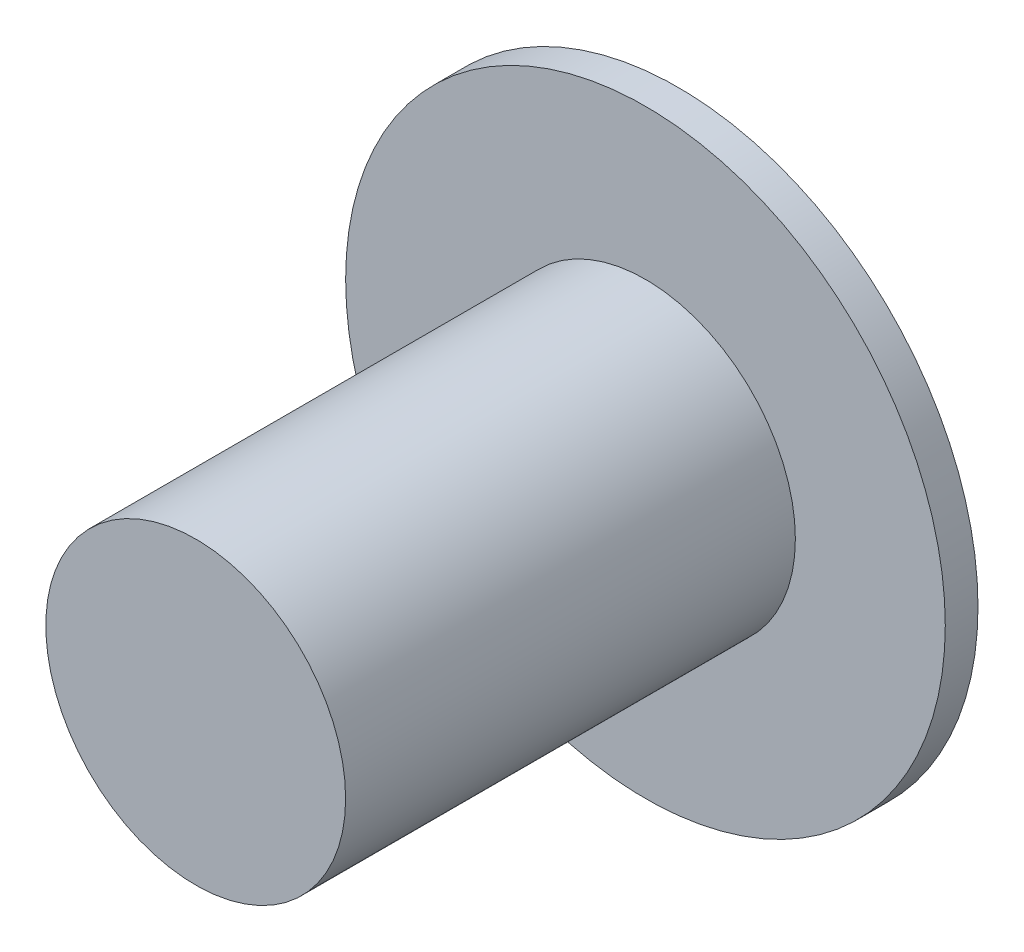
ISO-10303-21;
HEADER;
FILE_DESCRIPTION(('STEP AP214'),'2;1');
FILE_NAME('part.step','',(''),(''),'','','');
FILE_SCHEMA(('AUTOMOTIVE_DESIGN { 1 0 10303 214 1 1 1 1 }'));
ENDSEC;
DATA;
#1=APPLICATION_CONTEXT('core data for automotive mechanical design processes');
#2=APPLICATION_PROTOCOL_DEFINITION('international standard','automotive_design',2000,#1);
#3=PRODUCT_CONTEXT('',#1,'mechanical');
#4=PRODUCT('Part','Part','',(#3));
#5=PRODUCT_RELATED_PRODUCT_CATEGORY('part','',(#4));
#6=PRODUCT_DEFINITION_FORMATION('','',#4);
#7=PRODUCT_DEFINITION_CONTEXT('part definition',#1,'design');
#8=PRODUCT_DEFINITION('design','',#6,#7);
#9=PRODUCT_DEFINITION_SHAPE('','',#8);
#10=(LENGTH_UNIT() NAMED_UNIT(*) SI_UNIT(.MILLI.,.METRE.));
#11=(NAMED_UNIT(*) PLANE_ANGLE_UNIT() SI_UNIT($,.RADIAN.));
#12=(NAMED_UNIT(*) SI_UNIT($,.STERADIAN.) SOLID_ANGLE_UNIT());
#13=UNCERTAINTY_MEASURE_WITH_UNIT(LENGTH_MEASURE(1.E-05),#10,'distance_accuracy_value','');
#14=(GEOMETRIC_REPRESENTATION_CONTEXT(3) GLOBAL_UNCERTAINTY_ASSIGNED_CONTEXT((#13)) GLOBAL_UNIT_ASSIGNED_CONTEXT((#10,
#11,#12)) REPRESENTATION_CONTEXT('',''));
#15=CARTESIAN_POINT('',(0.,0.,0.));
#16=DIRECTION('',(0.,0.,1.));
#17=DIRECTION('',(1.,0.,0.));
#18=AXIS2_PLACEMENT_3D('',#15,#16,#17);
#19=CARTESIAN_POINT('',(0.,0.,5.));
#20=DIRECTION('',(0.,0.,-1.));
#21=DIRECTION('',(-1.,0.,0.));
#22=AXIS2_PLACEMENT_3D('',#19,#20,#21);
#23=CYLINDRICAL_SURFACE('',#22,11.);
#24=CARTESIAN_POINT('',(0.,0.,5.));
#25=DIRECTION('',(0.,0.,1.));
#26=DIRECTION('',(1.,0.,0.));
#27=AXIS2_PLACEMENT_3D('',#24,#25,#26);
#28=CIRCLE('',#27,11.);
#29=CARTESIAN_POINT('',(11.,0.,5.));
#30=VERTEX_POINT('',#29);
#31=EDGE_CURVE('E42',#30,#30,#28,.T.);
#32=ORIENTED_EDGE('',*,*,#31,.F.);
#33=EDGE_LOOP('',(#32));
#34=FACE_BOUND('',#33,.T.);
#35=CARTESIAN_POINT('',(0.,0.,0.));
#36=DIRECTION('',(0.,0.,1.));
#37=DIRECTION('',(1.,0.,0.));
#38=AXIS2_PLACEMENT_3D('',#35,#36,#37);
#39=CIRCLE('',#38,11.);
#40=CARTESIAN_POINT('',(11.,0.,0.));
#41=VERTEX_POINT('',#40);
#42=EDGE_CURVE('E38',#41,#41,#39,.T.);
#43=ORIENTED_EDGE('',*,*,#42,.T.);
#44=EDGE_LOOP('',(#43));
#45=FACE_BOUND('',#44,.T.);
#46=ADVANCED_FACE('F35',(#34,#45),#23,.T.);
#47=CARTESIAN_POINT('',(0.,0.,0.));
#48=DIRECTION('',(0.,0.,1.));
#49=DIRECTION('',(1.,0.,0.));
#50=AXIS2_PLACEMENT_3D('',#47,#48,#49);
#51=PLANE('',#50);
#52=ORIENTED_EDGE('',*,*,#42,.F.);
#53=EDGE_LOOP('',(#52));
#54=FACE_BOUND('',#53,.T.);
#55=ADVANCED_FACE('F76',(#54),#51,.F.);
#56=CARTESIAN_POINT('',(0.,0.,7.4));
#57=DIRECTION('',(0.,0.,-1.));
#58=DIRECTION('',(-1.,0.,0.));
#59=AXIS2_PLACEMENT_3D('',#56,#57,#58);
#60=CYLINDRICAL_SURFACE('',#59,22.);
#61=CARTESIAN_POINT('',(0.,0.,7.4));
#62=DIRECTION('',(0.,0.,1.));
#63=DIRECTION('',(1.,0.,0.));
#64=AXIS2_PLACEMENT_3D('',#61,#62,#63);
#65=CIRCLE('',#64,22.);
#66=CARTESIAN_POINT('',(22.,0.,7.4));
#67=VERTEX_POINT('',#66);
#68=EDGE_CURVE('E50',#67,#67,#65,.T.);
#69=ORIENTED_EDGE('',*,*,#68,.F.);
#70=EDGE_LOOP('',(#69));
#71=FACE_BOUND('',#70,.T.);
#72=CARTESIAN_POINT('',(0.,0.,5.));
#73=DIRECTION('',(0.,0.,1.));
#74=DIRECTION('',(1.,0.,0.));
#75=AXIS2_PLACEMENT_3D('',#72,#73,#74);
#76=CIRCLE('',#75,22.);
#77=CARTESIAN_POINT('',(22.,0.,5.));
#78=VERTEX_POINT('',#77);
#79=EDGE_CURVE('E53',#78,#78,#76,.T.);
#80=ORIENTED_EDGE('',*,*,#79,.T.);
#81=EDGE_LOOP('',(#80));
#82=FACE_BOUND('',#81,.T.);
#83=ADVANCED_FACE('F81',(#71,#82),#60,.T.);
#84=CARTESIAN_POINT('',(0.,0.,7.4));
#85=DIRECTION('',(0.,0.,1.));
#86=DIRECTION('',(1.,0.,0.));
#87=AXIS2_PLACEMENT_3D('',#84,#85,#86);
#88=PLANE('',#87);
#89=CARTESIAN_POINT('',(0.,0.,7.4));
#90=DIRECTION('',(0.,0.,1.));
#91=DIRECTION('',(1.,0.,0.));
#92=AXIS2_PLACEMENT_3D('',#89,#90,#91);
#93=CIRCLE('',#92,11.);
#94=CARTESIAN_POINT('',(11.,0.,7.4));
#95=VERTEX_POINT('',#94);
#96=EDGE_CURVE('E10',#95,#95,#93,.T.);
#97=ORIENTED_EDGE('',*,*,#96,.F.);
#98=EDGE_LOOP('',(#97));
#99=FACE_BOUND('',#98,.T.);
#100=ORIENTED_EDGE('',*,*,#68,.T.);
#101=EDGE_LOOP('',(#100));
#102=FACE_BOUND('',#101,.T.);
#103=ADVANCED_FACE('F71',(#99,#102),#88,.T.);
#104=CARTESIAN_POINT('',(0.,0.,5.));
#105=DIRECTION('',(0.,0.,1.));
#106=DIRECTION('',(1.,0.,0.));
#107=AXIS2_PLACEMENT_3D('',#104,#105,#106);
#108=PLANE('',#107);
#109=ORIENTED_EDGE('',*,*,#31,.T.);
#110=EDGE_LOOP('',(#109));
#111=FACE_BOUND('',#110,.T.);
#112=ORIENTED_EDGE('',*,*,#79,.F.);
#113=EDGE_LOOP('',(#112));
#114=FACE_BOUND('',#113,.T.);
#115=ADVANCED_FACE('F64',(#111,#114),#108,.F.);
#116=CARTESIAN_POINT('',(0.,0.,40.4));
#117=DIRECTION('',(0.,0.,-1.));
#118=DIRECTION('',(-1.,0.,0.));
#119=AXIS2_PLACEMENT_3D('',#116,#117,#118);
#120=CYLINDRICAL_SURFACE('',#119,11.);
#121=CARTESIAN_POINT('',(0.,0.,40.4));
#122=DIRECTION('',(0.,0.,1.));
#123=DIRECTION('',(1.,0.,0.));
#124=AXIS2_PLACEMENT_3D('',#121,#122,#123);
#125=CIRCLE('',#124,11.);
#126=CARTESIAN_POINT('',(11.,0.,40.4));
#127=VERTEX_POINT('',#126);
#128=EDGE_CURVE('E49',#127,#127,#125,.T.);
#129=ORIENTED_EDGE('',*,*,#128,.F.);
#130=EDGE_LOOP('',(#129));
#131=FACE_BOUND('',#130,.T.);
#132=ORIENTED_EDGE('',*,*,#96,.T.);
#133=EDGE_LOOP('',(#132));
#134=FACE_BOUND('',#133,.T.);
#135=ADVANCED_FACE('F62',(#131,#134),#120,.T.);
#136=CARTESIAN_POINT('',(0.,0.,40.4));
#137=DIRECTION('',(0.,0.,1.));
#138=DIRECTION('',(1.,0.,0.));
#139=AXIS2_PLACEMENT_3D('',#136,#137,#138);
#140=PLANE('',#139);
#141=ORIENTED_EDGE('',*,*,#128,.T.);
#142=EDGE_LOOP('',(#141));
#143=FACE_BOUND('',#142,.T.);
#144=ADVANCED_FACE('F60',(#143),#140,.T.);
#145=CLOSED_SHELL('',(#46,#55,#83,#103,#115,#135,#144));
#146=MANIFOLD_SOLID_BREP('B2',#145);
#147=ADVANCED_BREP_SHAPE_REPRESENTATION('',(#18,#146),#14);
#148=SHAPE_DEFINITION_REPRESENTATION(#9,#147);
ENDSEC;
END-ISO-10303-21;
